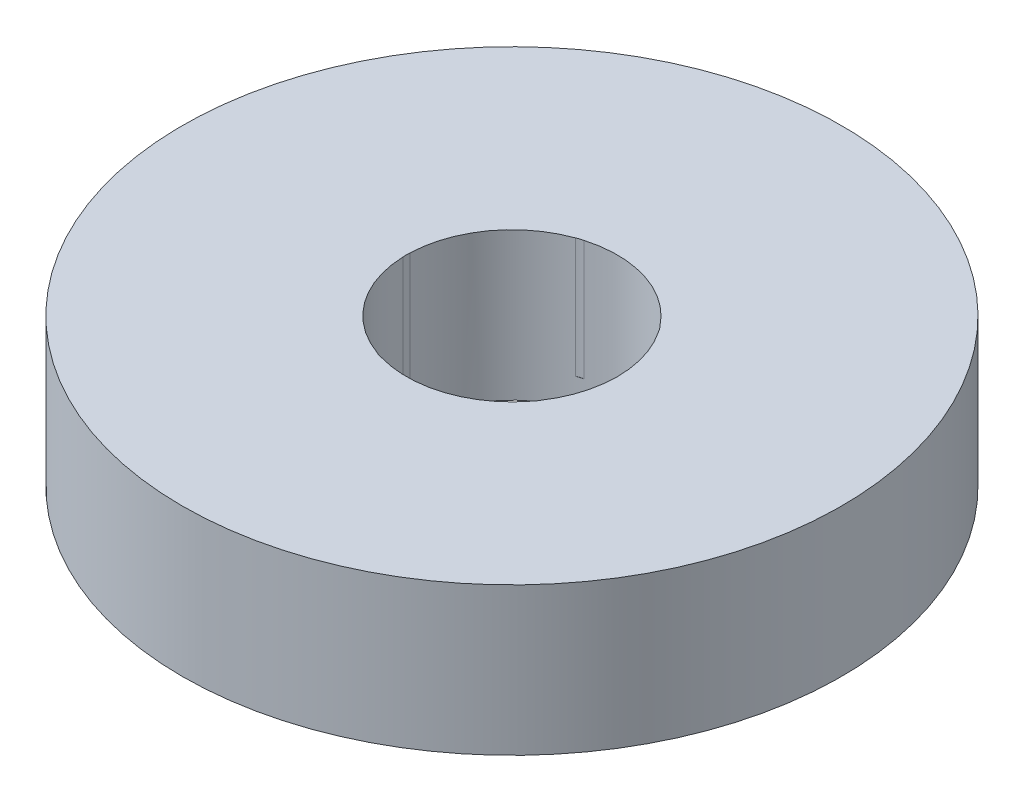
ISO-10303-21;
HEADER;
FILE_DESCRIPTION(('STEP AP214'),'2;1');
FILE_NAME('part.step','',(''),(''),'','','');
FILE_SCHEMA(('AUTOMOTIVE_DESIGN { 1 0 10303 214 1 1 1 1 }'));
ENDSEC;
DATA;
#1=APPLICATION_CONTEXT('core data for automotive mechanical design processes');
#2=APPLICATION_PROTOCOL_DEFINITION('international standard','automotive_design',2000,#1);
#3=PRODUCT_CONTEXT('',#1,'mechanical');
#4=PRODUCT('Part','Part','',(#3));
#5=PRODUCT_RELATED_PRODUCT_CATEGORY('part','',(#4));
#6=PRODUCT_DEFINITION_FORMATION('','',#4);
#7=PRODUCT_DEFINITION_CONTEXT('part definition',#1,'design');
#8=PRODUCT_DEFINITION('design','',#6,#7);
#9=PRODUCT_DEFINITION_SHAPE('','',#8);
#10=(LENGTH_UNIT() NAMED_UNIT(*) SI_UNIT(.MILLI.,.METRE.));
#11=(NAMED_UNIT(*) PLANE_ANGLE_UNIT() SI_UNIT($,.RADIAN.));
#12=(NAMED_UNIT(*) SI_UNIT($,.STERADIAN.) SOLID_ANGLE_UNIT());
#13=UNCERTAINTY_MEASURE_WITH_UNIT(LENGTH_MEASURE(1.E-05),#10,'distance_accuracy_value','');
#14=(GEOMETRIC_REPRESENTATION_CONTEXT(3) GLOBAL_UNCERTAINTY_ASSIGNED_CONTEXT((#13)) GLOBAL_UNIT_ASSIGNED_CONTEXT((#10,
#11,#12)) REPRESENTATION_CONTEXT('',''));
#15=CARTESIAN_POINT('',(0.,0.,0.));
#16=DIRECTION('',(0.,0.,1.));
#17=DIRECTION('',(1.,0.,0.));
#18=AXIS2_PLACEMENT_3D('',#15,#16,#17);
#19=CARTESIAN_POINT('',(0.,28.,0.));
#20=DIRECTION('',(0.,-1.,0.));
#21=DIRECTION('',(0.,0.,-1.));
#22=AXIS2_PLACEMENT_3D('',#19,#20,#21);
#23=CYLINDRICAL_SURFACE('',#22,62.5);
#24=CARTESIAN_POINT('',(0.,28.,0.));
#25=DIRECTION('',(0.,1.,0.));
#26=DIRECTION('',(0.,0.,1.));
#27=AXIS2_PLACEMENT_3D('',#24,#25,#26);
#28=CIRCLE('',#27,62.5);
#29=CARTESIAN_POINT('',(0.,28.,62.5));
#30=VERTEX_POINT('',#29);
#31=EDGE_CURVE('E151',#30,#30,#28,.T.);
#32=ORIENTED_EDGE('',*,*,#31,.F.);
#33=EDGE_LOOP('',(#32));
#34=FACE_BOUND('',#33,.T.);
#35=CARTESIAN_POINT('',(0.,0.,0.));
#36=DIRECTION('',(0.,1.,0.));
#37=DIRECTION('',(0.,0.,1.));
#38=AXIS2_PLACEMENT_3D('',#35,#36,#37);
#39=CIRCLE('',#38,62.5);
#40=CARTESIAN_POINT('',(0.,0.,62.5));
#41=VERTEX_POINT('',#40);
#42=EDGE_CURVE('E150',#41,#41,#39,.T.);
#43=ORIENTED_EDGE('',*,*,#42,.T.);
#44=EDGE_LOOP('',(#43));
#45=FACE_BOUND('',#44,.T.);
#46=ADVANCED_FACE('F39',(#34,#45),#23,.T.);
#47=CARTESIAN_POINT('',(0.,28.,0.));
#48=DIRECTION('',(0.,1.,0.));
#49=DIRECTION('',(0.,0.,1.));
#50=AXIS2_PLACEMENT_3D('',#47,#48,#49);
#51=PLANE('',#50);
#52=CARTESIAN_POINT('',(-4.70988260195025,28.,-14.4955281460499));
#53=DIRECTION('',(0.,1.,0.));
#54=DIRECTION('',(-0.95105651629515,0.,0.309016994374958));
#55=AXIS2_PLACEMENT_3D('',#52,#53,#54);
#56=CIRCLE('',#55,4.79218802469255);
#57=CARTESIAN_POINT('',(-5.5591942034221,28.,-19.211854668632));
#58=VERTEX_POINT('',#57);
#59=CARTESIAN_POINT('',(-6.79496225780945,28.,-18.8103292877861));
#60=VERTEX_POINT('',#59);
#61=EDGE_CURVE('E196',#58,#60,#56,.T.);
#62=ORIENTED_EDGE('',*,*,#61,.F.);
#63=CARTESIAN_POINT('',(0.,28.,0.));
#64=DIRECTION('',(0.,1.,0.));
#65=DIRECTION('',(0.,0.,1.));
#66=AXIS2_PLACEMENT_3D('',#63,#64,#65);
#67=CIRCLE('',#66,20.);
#68=CARTESIAN_POINT('',(15.7899274290071,28.,-12.275104552984));
#69=VERTEX_POINT('',#68);
#70=EDGE_CURVE('E156',#69,#58,#67,.T.);
#71=ORIENTED_EDGE('',*,*,#70,.F.);
#72=CARTESIAN_POINT('',(12.330632734927,28.,-8.95872907913971));
#73=DIRECTION('',(0.,1.,0.));
#74=DIRECTION('',(-0.58778525229248,0.,-0.809016994374942));
#75=AXIS2_PLACEMENT_3D('',#72,#73,#74);
#76=CIRCLE('',#75,4.79218802469255);
#77=CARTESIAN_POINT('',(16.5536740888299,28.,-11.2238974585838));
#78=VERTEX_POINT('',#77);
#79=EDGE_CURVE('E254',#78,#69,#76,.T.);
#80=ORIENTED_EDGE('',*,*,#79,.F.);
#81=CARTESIAN_POINT('',(16.55367408883,28.,11.2238974585835));
#82=VERTEX_POINT('',#81);
#83=EDGE_CURVE('E153',#82,#78,#67,.T.);
#84=ORIENTED_EDGE('',*,*,#83,.F.);
#85=CARTESIAN_POINT('',(12.3306327349272,28.,8.95872907913953));
#86=DIRECTION('',(0.,1.,0.));
#87=DIRECTION('',(0.587785252292469,0.,-0.809016994374951));
#88=AXIS2_PLACEMENT_3D('',#85,#86,#87);
#89=CIRCLE('',#88,4.79218802469255);
#90=CARTESIAN_POINT('',(15.7899274290073,28.,12.2751045529838));
#91=VERTEX_POINT('',#90);
#92=EDGE_CURVE('E248',#91,#82,#89,.T.);
#93=ORIENTED_EDGE('',*,*,#92,.F.);
#94=CARTESIAN_POINT('',(-5.55919420342181,28.,19.2118546686321));
#95=VERTEX_POINT('',#94);
#96=EDGE_CURVE('E140',#95,#91,#67,.T.);
#97=ORIENTED_EDGE('',*,*,#96,.F.);
#98=CARTESIAN_POINT('',(-4.70988260195004,28.,14.4955281460499));
#99=DIRECTION('',(0.,1.,0.));
#100=DIRECTION('',(0.951056516295155,0.,0.309016994374945));
#101=AXIS2_PLACEMENT_3D('',#98,#99,#100);
#102=CIRCLE('',#101,4.79218802469255);
#103=CARTESIAN_POINT('',(-6.7949622578092,28.,18.8103292877862));
#104=VERTEX_POINT('',#103);
#105=EDGE_CURVE('E117',#104,#95,#102,.T.);
#106=ORIENTED_EDGE('',*,*,#105,.F.);
#107=CARTESIAN_POINT('',(-19.9894450566061,28.,0.649681713554364));
#108=VERTEX_POINT('',#107);
#109=EDGE_CURVE('E133',#108,#104,#67,.T.);
#110=ORIENTED_EDGE('',*,*,#109,.F.);
#111=CARTESIAN_POINT('',(-15.2415002659541,28.,0.));
#112=DIRECTION('',(0.,1.,0.));
#113=DIRECTION('',(0.,0.,1.));
#114=AXIS2_PLACEMENT_3D('',#111,#112,#113);
#115=CIRCLE('',#114,4.79218802469255);
#116=CARTESIAN_POINT('',(-19.9894450566061,28.,-0.649681713554364));
#117=VERTEX_POINT('',#116);
#118=EDGE_CURVE('E170',#117,#108,#115,.T.);
#119=ORIENTED_EDGE('',*,*,#118,.F.);
#120=EDGE_CURVE('E149',#60,#117,#67,.T.);
#121=ORIENTED_EDGE('',*,*,#120,.F.);
#122=EDGE_LOOP('',(#62,#71,#80,#84,#93,#97,#106,#110,#119,#121));
#123=FACE_BOUND('',#122,.T.);
#124=ORIENTED_EDGE('',*,*,#31,.T.);
#125=EDGE_LOOP('',(#124));
#126=FACE_BOUND('',#125,.T.);
#127=ADVANCED_FACE('F131',(#123,#126),#51,.T.);
#128=CARTESIAN_POINT('',(0.,0.,0.));
#129=DIRECTION('',(0.,1.,0.));
#130=DIRECTION('',(0.,0.,1.));
#131=AXIS2_PLACEMENT_3D('',#128,#129,#130);
#132=PLANE('',#131);
#133=CARTESIAN_POINT('',(0.,0.,0.));
#134=DIRECTION('',(0.,1.,0.));
#135=DIRECTION('',(0.,0.,1.));
#136=AXIS2_PLACEMENT_3D('',#133,#134,#135);
#137=CIRCLE('',#136,20.);
#138=CARTESIAN_POINT('',(0.,0.,20.));
#139=VERTEX_POINT('',#138);
#140=EDGE_CURVE('E160',#139,#139,#137,.T.);
#141=ORIENTED_EDGE('',*,*,#140,.T.);
#142=EDGE_LOOP('',(#141));
#143=FACE_BOUND('',#142,.T.);
#144=ORIENTED_EDGE('',*,*,#42,.F.);
#145=EDGE_LOOP('',(#144));
#146=FACE_BOUND('',#145,.T.);
#147=ADVANCED_FACE('F212',(#143,#146),#132,.F.);
#148=CARTESIAN_POINT('',(0.,28.,0.));
#149=DIRECTION('',(0.,-1.,0.));
#150=DIRECTION('',(0.,0.,-1.));
#151=AXIS2_PLACEMENT_3D('',#148,#149,#150);
#152=CYLINDRICAL_SURFACE('',#151,20.);
#153=DIRECTION('',(0.,1.,0.));
#154=VECTOR('',#153,1.);
#155=CARTESIAN_POINT('',(-5.55919420342209,16.6321805245235,-19.211854668632));
#156=LINE('',#155,#154);
#157=CARTESIAN_POINT('',(-5.5591942034221,5.26436104904691,-19.211854668632));
#158=VERTEX_POINT('',#157);
#159=EDGE_CURVE('E11',#158,#58,#156,.T.);
#160=ORIENTED_EDGE('',*,*,#159,.F.);
#161=CARTESIAN_POINT('',(0.,5.26436104904691,0.));
#162=DIRECTION('',(0.,1.,0.));
#163=DIRECTION('',(0.,0.,1.));
#164=AXIS2_PLACEMENT_3D('',#161,#162,#163);
#165=CIRCLE('',#164,20.);
#166=CARTESIAN_POINT('',(-6.79496225780945,5.26436104904691,-18.8103292877861));
#167=VERTEX_POINT('',#166);
#168=EDGE_CURVE('E193',#158,#167,#165,.T.);
#169=ORIENTED_EDGE('',*,*,#168,.T.);
#170=DIRECTION('',(0.,1.,0.));
#171=VECTOR('',#170,1.);
#172=CARTESIAN_POINT('',(-6.79496225780946,16.6321805245235,-18.8103292877861));
#173=LINE('',#172,#171);
#174=EDGE_CURVE('E46',#60,#167,#173,.F.);
#175=ORIENTED_EDGE('',*,*,#174,.F.);
#176=ORIENTED_EDGE('',*,*,#120,.T.);
#177=DIRECTION('',(0.,1.,0.));
#178=VECTOR('',#177,1.);
#179=CARTESIAN_POINT('',(-19.9894450566061,16.6321805245235,-0.649681713554374));
#180=LINE('',#179,#178);
#181=CARTESIAN_POINT('',(-19.9894450566061,5.26436104904691,-0.649681713554364));
#182=VERTEX_POINT('',#181);
#183=EDGE_CURVE('E174',#182,#117,#180,.T.);
#184=ORIENTED_EDGE('',*,*,#183,.F.);
#185=CARTESIAN_POINT('',(0.,5.26436104904691,0.));
#186=DIRECTION('',(0.,1.,0.));
#187=DIRECTION('',(0.,0.,1.));
#188=AXIS2_PLACEMENT_3D('',#185,#186,#187);
#189=CIRCLE('',#188,20.);
#190=CARTESIAN_POINT('',(-19.9894450566061,5.26436104904691,0.649681713554364));
#191=VERTEX_POINT('',#190);
#192=EDGE_CURVE('E171',#182,#191,#189,.T.);
#193=ORIENTED_EDGE('',*,*,#192,.T.);
#194=DIRECTION('',(0.,1.,0.));
#195=VECTOR('',#194,1.);
#196=CARTESIAN_POINT('',(-19.9894450566061,16.6321805245235,0.649681713554374));
#197=LINE('',#196,#195);
#198=EDGE_CURVE('E148',#108,#191,#197,.F.);
#199=ORIENTED_EDGE('',*,*,#198,.F.);
#200=ORIENTED_EDGE('',*,*,#109,.T.);
#201=DIRECTION('',(0.,1.,0.));
#202=VECTOR('',#201,1.);
#203=CARTESIAN_POINT('',(-6.7949622578092,16.6321805245235,18.8103292877862));
#204=LINE('',#203,#202);
#205=CARTESIAN_POINT('',(-6.7949622578092,5.26436104904691,18.8103292877862));
#206=VERTEX_POINT('',#205);
#207=EDGE_CURVE('E111',#206,#104,#204,.T.);
#208=ORIENTED_EDGE('',*,*,#207,.F.);
#209=CARTESIAN_POINT('',(0.,5.26436104904691,0.));
#210=DIRECTION('',(0.,1.,0.));
#211=DIRECTION('',(0.,0.,1.));
#212=AXIS2_PLACEMENT_3D('',#209,#210,#211);
#213=CIRCLE('',#212,20.);
#214=CARTESIAN_POINT('',(-5.55919420342181,5.26436104904691,19.2118546686321));
#215=VERTEX_POINT('',#214);
#216=EDGE_CURVE('E180',#206,#215,#213,.T.);
#217=ORIENTED_EDGE('',*,*,#216,.T.);
#218=DIRECTION('',(0.,1.,0.));
#219=VECTOR('',#218,1.);
#220=CARTESIAN_POINT('',(-5.55919420342182,16.6321805245235,19.2118546686321));
#221=LINE('',#220,#219);
#222=EDGE_CURVE('E124',#95,#215,#221,.F.);
#223=ORIENTED_EDGE('',*,*,#222,.F.);
#224=ORIENTED_EDGE('',*,*,#96,.T.);
#225=DIRECTION('',(0.,1.,0.));
#226=VECTOR('',#225,1.);
#227=CARTESIAN_POINT('',(15.7899274290073,16.6321805245235,12.2751045529838));
#228=LINE('',#227,#226);
#229=CARTESIAN_POINT('',(15.7899274290073,5.26436104904691,12.2751045529838));
#230=VERTEX_POINT('',#229);
#231=EDGE_CURVE('E183',#230,#91,#228,.T.);
#232=ORIENTED_EDGE('',*,*,#231,.F.);
#233=CARTESIAN_POINT('',(0.,5.26436104904691,0.));
#234=DIRECTION('',(0.,1.,0.));
#235=DIRECTION('',(0.,0.,1.));
#236=AXIS2_PLACEMENT_3D('',#233,#234,#235);
#237=CIRCLE('',#236,20.);
#238=CARTESIAN_POINT('',(16.55367408883,5.26436104904691,11.2238974585835));
#239=VERTEX_POINT('',#238);
#240=EDGE_CURVE('E123',#230,#239,#237,.T.);
#241=ORIENTED_EDGE('',*,*,#240,.T.);
#242=DIRECTION('',(0.,1.,0.));
#243=VECTOR('',#242,1.);
#244=CARTESIAN_POINT('',(16.55367408883,16.6321805245235,11.2238974585835));
#245=LINE('',#244,#243);
#246=EDGE_CURVE('E185',#82,#239,#245,.F.);
#247=ORIENTED_EDGE('',*,*,#246,.F.);
#248=ORIENTED_EDGE('',*,*,#83,.T.);
#249=DIRECTION('',(0.,1.,0.));
#250=VECTOR('',#249,1.);
#251=CARTESIAN_POINT('',(16.5536740888299,16.6321805245235,-11.2238974585838));
#252=LINE('',#251,#250);
#253=CARTESIAN_POINT('',(16.5536740888299,5.26436104904691,-11.2238974585838));
#254=VERTEX_POINT('',#253);
#255=EDGE_CURVE('E195',#254,#78,#252,.T.);
#256=ORIENTED_EDGE('',*,*,#255,.F.);
#257=CARTESIAN_POINT('',(0.,5.26436104904691,0.));
#258=DIRECTION('',(0.,1.,0.));
#259=DIRECTION('',(0.,0.,1.));
#260=AXIS2_PLACEMENT_3D('',#257,#258,#259);
#261=CIRCLE('',#260,20.);
#262=CARTESIAN_POINT('',(15.7899274290071,5.26436104904691,-12.275104552984));
#263=VERTEX_POINT('',#262);
#264=EDGE_CURVE('E190',#254,#263,#261,.T.);
#265=ORIENTED_EDGE('',*,*,#264,.T.);
#266=DIRECTION('',(0.,1.,0.));
#267=VECTOR('',#266,1.);
#268=CARTESIAN_POINT('',(15.7899274290071,16.6321805245235,-12.275104552984));
#269=LINE('',#268,#267);
#270=EDGE_CURVE('E189',#69,#263,#269,.F.);
#271=ORIENTED_EDGE('',*,*,#270,.F.);
#272=ORIENTED_EDGE('',*,*,#70,.T.);
#273=EDGE_LOOP('',(#160,#169,#175,#176,#184,#193,#199,#200,#208,#217,#223,#224,#232,#241,#247,
#248,#256,#265,#271,#272));
#274=FACE_BOUND('',#273,.T.);
#275=ORIENTED_EDGE('',*,*,#140,.F.);
#276=EDGE_LOOP('',(#275));
#277=FACE_BOUND('',#276,.T.);
#278=ADVANCED_FACE('F142',(#274,#277),#152,.F.);
#279=CARTESIAN_POINT('',(-15.2415002659541,5.26436104904691,0.));
#280=DIRECTION('',(0.,1.,0.));
#281=DIRECTION('',(0.,0.,1.));
#282=AXIS2_PLACEMENT_3D('',#279,#280,#281);
#283=CYLINDRICAL_SURFACE('',#282,4.79218802469255);
#284=ORIENTED_EDGE('',*,*,#183,.T.);
#285=ORIENTED_EDGE('',*,*,#118,.T.);
#286=ORIENTED_EDGE('',*,*,#198,.T.);
#287=CARTESIAN_POINT('',(-15.2415002659541,5.26436104904691,0.));
#288=DIRECTION('',(0.,1.,0.));
#289=DIRECTION('',(0.,0.,1.));
#290=AXIS2_PLACEMENT_3D('',#287,#288,#289);
#291=CIRCLE('',#290,4.79218802469255);
#292=EDGE_CURVE('E163',#182,#191,#291,.T.);
#293=ORIENTED_EDGE('',*,*,#292,.F.);
#294=EDGE_LOOP('',(#284,#285,#286,#293));
#295=FACE_BOUND('',#294,.T.);
#296=ADVANCED_FACE('F221',(#295),#283,.F.);
#297=CARTESIAN_POINT('',(-15.2415002659541,5.26436104904691,0.));
#298=DIRECTION('',(0.,1.,0.));
#299=DIRECTION('',(0.,0.,1.));
#300=AXIS2_PLACEMENT_3D('',#297,#298,#299);
#301=PLANE('',#300);
#302=ORIENTED_EDGE('',*,*,#292,.T.);
#303=ORIENTED_EDGE('',*,*,#192,.F.);
#304=EDGE_LOOP('',(#302,#303));
#305=FACE_BOUND('',#304,.T.);
#306=ADVANCED_FACE('F227',(#305),#301,.T.);
#307=CARTESIAN_POINT('',(-4.70988260195004,5.26436104904691,14.4955281460499));
#308=DIRECTION('',(0.,1.,0.));
#309=DIRECTION('',(0.,0.,1.));
#310=AXIS2_PLACEMENT_3D('',#307,#308,#309);
#311=CYLINDRICAL_SURFACE('',#310,4.79218802469255);
#312=ORIENTED_EDGE('',*,*,#207,.T.);
#313=ORIENTED_EDGE('',*,*,#105,.T.);
#314=ORIENTED_EDGE('',*,*,#222,.T.);
#315=CARTESIAN_POINT('',(-4.70988260195004,5.26436104904691,14.4955281460499));
#316=DIRECTION('',(0.,1.,0.));
#317=DIRECTION('',(0.951056516295155,0.,0.309016994374945));
#318=AXIS2_PLACEMENT_3D('',#315,#316,#317);
#319=CIRCLE('',#318,4.79218802469255);
#320=EDGE_CURVE('E119',#206,#215,#319,.T.);
#321=ORIENTED_EDGE('',*,*,#320,.F.);
#322=EDGE_LOOP('',(#312,#313,#314,#321));
#323=FACE_BOUND('',#322,.T.);
#324=ADVANCED_FACE('F116',(#323),#311,.F.);
#325=CARTESIAN_POINT('',(-4.70988260195004,5.26436104904691,14.4955281460499));
#326=DIRECTION('',(0.,1.,0.));
#327=DIRECTION('',(0.951056516295155,0.,0.309016994374945));
#328=AXIS2_PLACEMENT_3D('',#325,#326,#327);
#329=PLANE('',#328);
#330=ORIENTED_EDGE('',*,*,#320,.T.);
#331=ORIENTED_EDGE('',*,*,#216,.F.);
#332=EDGE_LOOP('',(#330,#331));
#333=FACE_BOUND('',#332,.T.);
#334=ADVANCED_FACE('F234',(#333),#329,.T.);
#335=CARTESIAN_POINT('',(12.3306327349272,5.26436104904691,8.95872907913953));
#336=DIRECTION('',(0.,1.,0.));
#337=DIRECTION('',(0.,0.,1.));
#338=AXIS2_PLACEMENT_3D('',#335,#336,#337);
#339=CYLINDRICAL_SURFACE('',#338,4.79218802469255);
#340=ORIENTED_EDGE('',*,*,#231,.T.);
#341=ORIENTED_EDGE('',*,*,#92,.T.);
#342=ORIENTED_EDGE('',*,*,#246,.T.);
#343=CARTESIAN_POINT('',(12.3306327349272,5.26436104904691,8.95872907913953));
#344=DIRECTION('',(0.,1.,0.));
#345=DIRECTION('',(0.587785252292469,0.,-0.809016994374951));
#346=AXIS2_PLACEMENT_3D('',#343,#344,#345);
#347=CIRCLE('',#346,4.79218802469255);
#348=EDGE_CURVE('E137',#230,#239,#347,.T.);
#349=ORIENTED_EDGE('',*,*,#348,.F.);
#350=EDGE_LOOP('',(#340,#341,#342,#349));
#351=FACE_BOUND('',#350,.T.);
#352=ADVANCED_FACE('F240',(#351),#339,.F.);
#353=CARTESIAN_POINT('',(12.3306327349272,5.26436104904691,8.95872907913953));
#354=DIRECTION('',(0.,1.,0.));
#355=DIRECTION('',(0.587785252292469,0.,-0.809016994374951));
#356=AXIS2_PLACEMENT_3D('',#353,#354,#355);
#357=PLANE('',#356);
#358=ORIENTED_EDGE('',*,*,#348,.T.);
#359=ORIENTED_EDGE('',*,*,#240,.F.);
#360=EDGE_LOOP('',(#358,#359));
#361=FACE_BOUND('',#360,.T.);
#362=ADVANCED_FACE('F245',(#361),#357,.T.);
#363=CARTESIAN_POINT('',(12.330632734927,5.26436104904691,-8.95872907913971));
#364=DIRECTION('',(0.,1.,0.));
#365=DIRECTION('',(0.,0.,1.));
#366=AXIS2_PLACEMENT_3D('',#363,#364,#365);
#367=CYLINDRICAL_SURFACE('',#366,4.79218802469255);
#368=ORIENTED_EDGE('',*,*,#255,.T.);
#369=ORIENTED_EDGE('',*,*,#79,.T.);
#370=ORIENTED_EDGE('',*,*,#270,.T.);
#371=CARTESIAN_POINT('',(12.330632734927,5.26436104904691,-8.95872907913971));
#372=DIRECTION('',(0.,1.,0.));
#373=DIRECTION('',(-0.58778525229248,0.,-0.809016994374942));
#374=AXIS2_PLACEMENT_3D('',#371,#372,#373);
#375=CIRCLE('',#374,4.79218802469255);
#376=EDGE_CURVE('E56',#254,#263,#375,.T.);
#377=ORIENTED_EDGE('',*,*,#376,.F.);
#378=EDGE_LOOP('',(#368,#369,#370,#377));
#379=FACE_BOUND('',#378,.T.);
#380=ADVANCED_FACE('F264',(#379),#367,.F.);
#381=CARTESIAN_POINT('',(12.330632734927,5.26436104904691,-8.95872907913971));
#382=DIRECTION('',(0.,1.,0.));
#383=DIRECTION('',(-0.58778525229248,0.,-0.809016994374942));
#384=AXIS2_PLACEMENT_3D('',#381,#382,#383);
#385=PLANE('',#384);
#386=ORIENTED_EDGE('',*,*,#376,.T.);
#387=ORIENTED_EDGE('',*,*,#264,.F.);
#388=EDGE_LOOP('',(#386,#387));
#389=FACE_BOUND('',#388,.T.);
#390=ADVANCED_FACE('F202',(#389),#385,.T.);
#391=CARTESIAN_POINT('',(-4.70988260195025,5.26436104904691,-14.4955281460499));
#392=DIRECTION('',(0.,1.,0.));
#393=DIRECTION('',(0.,0.,1.));
#394=AXIS2_PLACEMENT_3D('',#391,#392,#393);
#395=CYLINDRICAL_SURFACE('',#394,4.79218802469255);
#396=ORIENTED_EDGE('',*,*,#159,.T.);
#397=ORIENTED_EDGE('',*,*,#61,.T.);
#398=ORIENTED_EDGE('',*,*,#174,.T.);
#399=CARTESIAN_POINT('',(-4.70988260195025,5.26436104904691,-14.4955281460499));
#400=DIRECTION('',(0.,1.,0.));
#401=DIRECTION('',(-0.95105651629515,0.,0.309016994374958));
#402=AXIS2_PLACEMENT_3D('',#399,#400,#401);
#403=CIRCLE('',#402,4.79218802469255);
#404=EDGE_CURVE('E55',#158,#167,#403,.T.);
#405=ORIENTED_EDGE('',*,*,#404,.F.);
#406=EDGE_LOOP('',(#396,#397,#398,#405));
#407=FACE_BOUND('',#406,.T.);
#408=ADVANCED_FACE('F197',(#407),#395,.F.);
#409=CARTESIAN_POINT('',(-4.70988260195025,5.26436104904691,-14.4955281460499));
#410=DIRECTION('',(0.,1.,0.));
#411=DIRECTION('',(-0.95105651629515,0.,0.309016994374958));
#412=AXIS2_PLACEMENT_3D('',#409,#410,#411);
#413=PLANE('',#412);
#414=ORIENTED_EDGE('',*,*,#404,.T.);
#415=ORIENTED_EDGE('',*,*,#168,.F.);
#416=EDGE_LOOP('',(#414,#415));
#417=FACE_BOUND('',#416,.T.);
#418=ADVANCED_FACE('F200',(#417),#413,.T.);
#419=CLOSED_SHELL('',(#46,#127,#147,#278,#296,#306,#324,#334,#352,#362,#380,#390,#408,#418));
#420=MANIFOLD_SOLID_BREP('B2',#419);
#421=ADVANCED_BREP_SHAPE_REPRESENTATION('',(#18,#420),#14);
#422=SHAPE_DEFINITION_REPRESENTATION(#9,#421);
ENDSEC;
END-ISO-10303-21;
